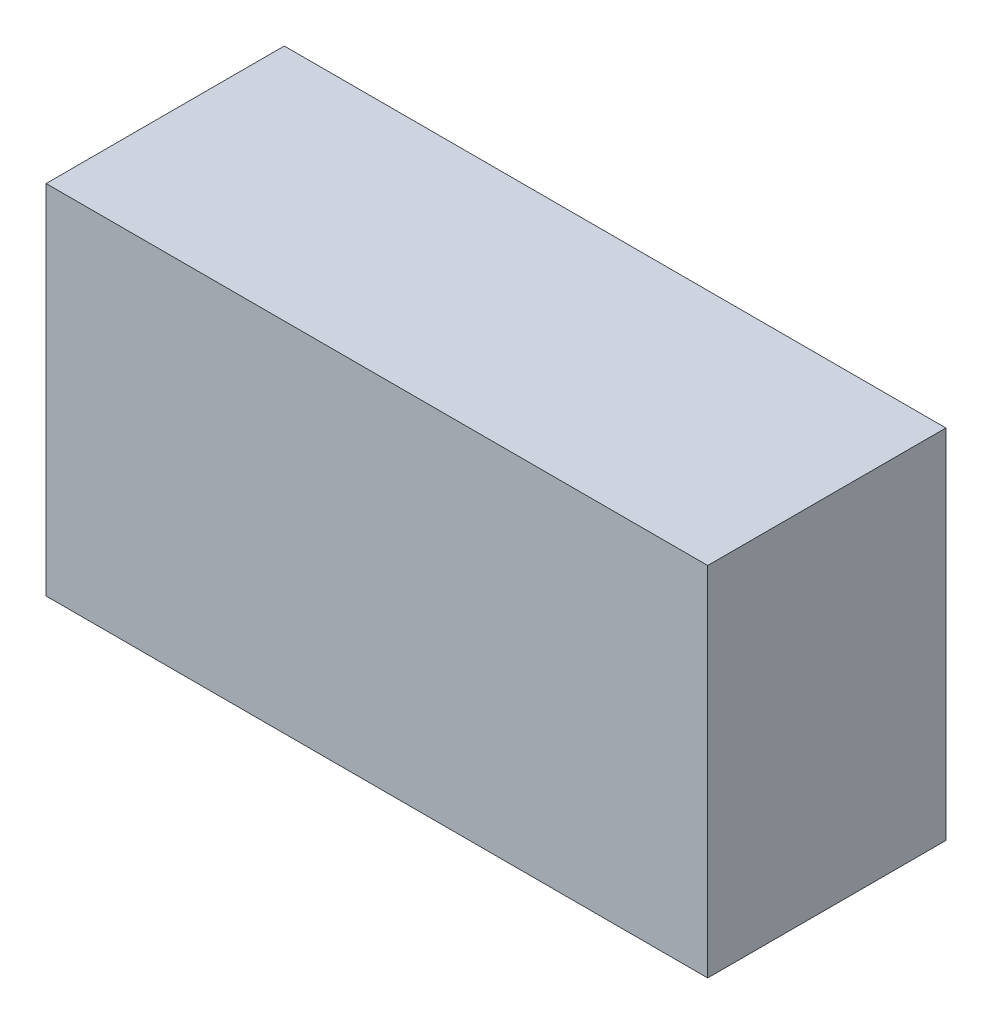
ISO-10303-21;
HEADER;
FILE_DESCRIPTION(('STEP AP214'),'2;1');
FILE_NAME('part.step','',(''),(''),'','','');
FILE_SCHEMA(('AUTOMOTIVE_DESIGN { 1 0 10303 214 1 1 1 1 }'));
ENDSEC;
DATA;
#1=APPLICATION_CONTEXT('core data for automotive mechanical design processes');
#2=APPLICATION_PROTOCOL_DEFINITION('international standard','automotive_design',2000,#1);
#3=PRODUCT_CONTEXT('',#1,'mechanical');
#4=PRODUCT('Part','Part','',(#3));
#5=PRODUCT_RELATED_PRODUCT_CATEGORY('part','',(#4));
#6=PRODUCT_DEFINITION_FORMATION('','',#4);
#7=PRODUCT_DEFINITION_CONTEXT('part definition',#1,'design');
#8=PRODUCT_DEFINITION('design','',#6,#7);
#9=PRODUCT_DEFINITION_SHAPE('','',#8);
#10=(LENGTH_UNIT() NAMED_UNIT(*) SI_UNIT(.MILLI.,.METRE.));
#11=(NAMED_UNIT(*) PLANE_ANGLE_UNIT() SI_UNIT($,.RADIAN.));
#12=(NAMED_UNIT(*) SI_UNIT($,.STERADIAN.) SOLID_ANGLE_UNIT());
#13=UNCERTAINTY_MEASURE_WITH_UNIT(LENGTH_MEASURE(1.E-05),#10,'distance_accuracy_value','');
#14=(GEOMETRIC_REPRESENTATION_CONTEXT(3) GLOBAL_UNCERTAINTY_ASSIGNED_CONTEXT((#13)) GLOBAL_UNIT_ASSIGNED_CONTEXT((#10,
#11,#12)) REPRESENTATION_CONTEXT('',''));
#15=CARTESIAN_POINT('',(0.,0.,0.));
#16=DIRECTION('',(0.,0.,1.));
#17=DIRECTION('',(1.,0.,0.));
#18=AXIS2_PLACEMENT_3D('',#15,#16,#17);
#19=CARTESIAN_POINT('',(-50.,27.,18.));
#20=DIRECTION('',(1.,0.,0.));
#21=DIRECTION('',(0.,1.,0.));
#22=AXIS2_PLACEMENT_3D('',#19,#20,#21);
#23=PLANE('',#22);
#24=CARTESIAN_POINT('',(-50.,20.25,9.));
#25=DIRECTION('',(1.,0.,0.));
#26=DIRECTION('',(0.,1.,0.));
#27=AXIS2_PLACEMENT_3D('',#24,#25,#26);
#28=CIRCLE('',#27,3.);
#29=CARTESIAN_POINT('',(-50.,23.25,9.));
#30=VERTEX_POINT('',#29);
#31=EDGE_CURVE('E111',#30,#30,#28,.F.);
#32=ORIENTED_EDGE('',*,*,#31,.F.);
#33=EDGE_LOOP('',(#32));
#34=FACE_BOUND('',#33,.T.);
#35=DIRECTION('',(0.,-1.,0.));
#36=VECTOR('',#35,1.);
#37=CARTESIAN_POINT('',(-50.,27.,0.));
#38=LINE('',#37,#36);
#39=CARTESIAN_POINT('',(-50.,27.,0.));
#40=VERTEX_POINT('',#39);
#41=CARTESIAN_POINT('',(-50.,0.,0.));
#42=VERTEX_POINT('',#41);
#43=EDGE_CURVE('E101',#40,#42,#38,.T.);
#44=ORIENTED_EDGE('',*,*,#43,.T.);
#45=DIRECTION('',(0.,0.,-1.));
#46=VECTOR('',#45,1.);
#47=CARTESIAN_POINT('',(-50.,0.,18.));
#48=LINE('',#47,#46);
#49=CARTESIAN_POINT('',(-50.,0.,18.));
#50=VERTEX_POINT('',#49);
#51=EDGE_CURVE('E92',#50,#42,#48,.T.);
#52=ORIENTED_EDGE('',*,*,#51,.F.);
#53=DIRECTION('',(0.,-1.,0.));
#54=VECTOR('',#53,1.);
#55=CARTESIAN_POINT('',(-50.,27.,18.));
#56=LINE('',#55,#54);
#57=CARTESIAN_POINT('',(-50.,27.,18.));
#58=VERTEX_POINT('',#57);
#59=EDGE_CURVE('E86',#58,#50,#56,.T.);
#60=ORIENTED_EDGE('',*,*,#59,.F.);
#61=DIRECTION('',(0.,0.,-1.));
#62=VECTOR('',#61,1.);
#63=CARTESIAN_POINT('',(-50.,27.,18.));
#64=LINE('',#63,#62);
#65=EDGE_CURVE('E97',#58,#40,#64,.T.);
#66=ORIENTED_EDGE('',*,*,#65,.T.);
#67=EDGE_LOOP('',(#44,#52,#60,#66));
#68=FACE_BOUND('',#67,.T.);
#69=CARTESIAN_POINT('',(-50.,6.74999999999997,9.));
#70=DIRECTION('',(1.,0.,0.));
#71=DIRECTION('',(0.,1.,0.));
#72=AXIS2_PLACEMENT_3D('',#69,#70,#71);
#73=CIRCLE('',#72,3.);
#74=CARTESIAN_POINT('',(-50.,9.74999999999997,9.));
#75=VERTEX_POINT('',#74);
#76=EDGE_CURVE('E114',#75,#75,#73,.F.);
#77=ORIENTED_EDGE('',*,*,#76,.F.);
#78=EDGE_LOOP('',(#77));
#79=FACE_BOUND('',#78,.T.);
#80=ADVANCED_FACE('F33',(#34,#68,#79),#23,.F.);
#81=CARTESIAN_POINT('',(-50.,0.,18.));
#82=DIRECTION('',(0.,1.,0.));
#83=DIRECTION('',(0.,0.,1.));
#84=AXIS2_PLACEMENT_3D('',#81,#82,#83);
#85=PLANE('',#84);
#86=DIRECTION('',(1.,0.,0.));
#87=VECTOR('',#86,1.);
#88=CARTESIAN_POINT('',(-50.,0.,0.));
#89=LINE('',#88,#87);
#90=CARTESIAN_POINT('',(0.,0.,0.));
#91=VERTEX_POINT('',#90);
#92=EDGE_CURVE('E91',#42,#91,#89,.T.);
#93=ORIENTED_EDGE('',*,*,#92,.T.);
#94=DIRECTION('',(0.,0.,-1.));
#95=VECTOR('',#94,1.);
#96=CARTESIAN_POINT('',(0.,0.,18.));
#97=LINE('',#96,#95);
#98=CARTESIAN_POINT('',(0.,0.,18.));
#99=VERTEX_POINT('',#98);
#100=EDGE_CURVE('E89',#99,#91,#97,.T.);
#101=ORIENTED_EDGE('',*,*,#100,.F.);
#102=DIRECTION('',(1.,0.,0.));
#103=VECTOR('',#102,1.);
#104=CARTESIAN_POINT('',(-50.,0.,18.));
#105=LINE('',#104,#103);
#106=EDGE_CURVE('E81',#50,#99,#105,.T.);
#107=ORIENTED_EDGE('',*,*,#106,.F.);
#108=ORIENTED_EDGE('',*,*,#51,.T.);
#109=EDGE_LOOP('',(#93,#101,#107,#108));
#110=FACE_BOUND('',#109,.T.);
#111=ADVANCED_FACE('F90',(#110),#85,.F.);
#112=CARTESIAN_POINT('',(0.,27.,18.));
#113=DIRECTION('',(-1.,0.,0.));
#114=DIRECTION('',(0.,-1.,0.));
#115=AXIS2_PLACEMENT_3D('',#112,#113,#114);
#116=PLANE('',#115);
#117=DIRECTION('',(0.,1.,0.));
#118=VECTOR('',#117,1.);
#119=CARTESIAN_POINT('',(0.,27.,0.));
#120=LINE('',#119,#118);
#121=CARTESIAN_POINT('',(0.,27.,0.));
#122=VERTEX_POINT('',#121);
#123=EDGE_CURVE('E67',#91,#122,#120,.T.);
#124=ORIENTED_EDGE('',*,*,#123,.T.);
#125=DIRECTION('',(0.,0.,-1.));
#126=VECTOR('',#125,1.);
#127=CARTESIAN_POINT('',(0.,27.,18.));
#128=LINE('',#127,#126);
#129=CARTESIAN_POINT('',(0.,27.,18.));
#130=VERTEX_POINT('',#129);
#131=EDGE_CURVE('E93',#130,#122,#128,.T.);
#132=ORIENTED_EDGE('',*,*,#131,.F.);
#133=DIRECTION('',(0.,1.,0.));
#134=VECTOR('',#133,1.);
#135=CARTESIAN_POINT('',(0.,27.,18.));
#136=LINE('',#135,#134);
#137=EDGE_CURVE('E84',#99,#130,#136,.T.);
#138=ORIENTED_EDGE('',*,*,#137,.F.);
#139=ORIENTED_EDGE('',*,*,#100,.T.);
#140=EDGE_LOOP('',(#124,#132,#138,#139));
#141=FACE_BOUND('',#140,.T.);
#142=ADVANCED_FACE('F95',(#141),#116,.F.);
#143=CARTESIAN_POINT('',(-50.,27.,18.));
#144=DIRECTION('',(0.,-1.,0.));
#145=DIRECTION('',(1.,0.,0.));
#146=AXIS2_PLACEMENT_3D('',#143,#144,#145);
#147=PLANE('',#146);
#148=DIRECTION('',(-1.,0.,0.));
#149=VECTOR('',#148,1.);
#150=CARTESIAN_POINT('',(-50.,27.,0.));
#151=LINE('',#150,#149);
#152=EDGE_CURVE('E73',#122,#40,#151,.T.);
#153=ORIENTED_EDGE('',*,*,#152,.T.);
#154=ORIENTED_EDGE('',*,*,#65,.F.);
#155=DIRECTION('',(-1.,0.,0.));
#156=VECTOR('',#155,1.);
#157=CARTESIAN_POINT('',(-50.,27.,18.));
#158=LINE('',#157,#156);
#159=EDGE_CURVE('E50',#130,#58,#158,.T.);
#160=ORIENTED_EDGE('',*,*,#159,.F.);
#161=ORIENTED_EDGE('',*,*,#131,.T.);
#162=EDGE_LOOP('',(#153,#154,#160,#161));
#163=FACE_BOUND('',#162,.T.);
#164=ADVANCED_FACE('F155',(#163),#147,.F.);
#165=CARTESIAN_POINT('',(0.,0.,18.));
#166=DIRECTION('',(0.,0.,1.));
#167=DIRECTION('',(1.,0.,0.));
#168=AXIS2_PLACEMENT_3D('',#165,#166,#167);
#169=PLANE('',#168);
#170=ORIENTED_EDGE('',*,*,#59,.T.);
#171=ORIENTED_EDGE('',*,*,#106,.T.);
#172=ORIENTED_EDGE('',*,*,#137,.T.);
#173=ORIENTED_EDGE('',*,*,#159,.T.);
#174=EDGE_LOOP('',(#170,#171,#172,#173));
#175=FACE_BOUND('',#174,.T.);
#176=ADVANCED_FACE('F82',(#175),#169,.T.);
#177=CARTESIAN_POINT('',(0.,0.,0.));
#178=DIRECTION('',(0.,0.,1.));
#179=DIRECTION('',(1.,0.,0.));
#180=AXIS2_PLACEMENT_3D('',#177,#178,#179);
#181=PLANE('',#180);
#182=ORIENTED_EDGE('',*,*,#43,.F.);
#183=ORIENTED_EDGE('',*,*,#152,.F.);
#184=ORIENTED_EDGE('',*,*,#123,.F.);
#185=ORIENTED_EDGE('',*,*,#92,.F.);
#186=EDGE_LOOP('',(#182,#183,#184,#185));
#187=FACE_BOUND('',#186,.T.);
#188=ADVANCED_FACE('F141',(#187),#181,.F.);
#189=CARTESIAN_POINT('',(-52.,20.25,9.));
#190=DIRECTION('',(1.,0.,0.));
#191=DIRECTION('',(0.,1.,0.));
#192=AXIS2_PLACEMENT_3D('',#189,#190,#191);
#193=CYLINDRICAL_SURFACE('',#192,3.);
#194=CARTESIAN_POINT('',(-51.,20.25,9.));
#195=DIRECTION('',(-1.,0.,0.));
#196=DIRECTION('',(0.,-1.,0.));
#197=AXIS2_PLACEMENT_3D('',#194,#195,#196);
#198=CIRCLE('',#197,3.);
#199=CARTESIAN_POINT('',(-51.,17.25,9.));
#200=VERTEX_POINT('',#199);
#201=EDGE_CURVE('E42',#200,#200,#198,.F.);
#202=ORIENTED_EDGE('',*,*,#201,.T.);
#203=EDGE_LOOP('',(#202));
#204=FACE_BOUND('',#203,.T.);
#205=ORIENTED_EDGE('',*,*,#31,.T.);
#206=EDGE_LOOP('',(#205));
#207=FACE_BOUND('',#206,.T.);
#208=ADVANCED_FACE('F122',(#204,#207),#193,.T.);
#209=CARTESIAN_POINT('',(-52.,20.25,9.));
#210=DIRECTION('',(-1.,0.,0.));
#211=DIRECTION('',(0.,-1.,0.));
#212=AXIS2_PLACEMENT_3D('',#209,#210,#211);
#213=PLANE('',#212);
#214=CARTESIAN_POINT('',(-52.,20.25,9.));
#215=DIRECTION('',(-1.,0.,0.));
#216=DIRECTION('',(0.,-1.,0.));
#217=AXIS2_PLACEMENT_3D('',#214,#215,#216);
#218=CIRCLE('',#217,2.);
#219=CARTESIAN_POINT('',(-52.,18.25,9.));
#220=VERTEX_POINT('',#219);
#221=EDGE_CURVE('E117',#220,#220,#218,.T.);
#222=ORIENTED_EDGE('',*,*,#221,.T.);
#223=EDGE_LOOP('',(#222));
#224=FACE_BOUND('',#223,.T.);
#225=ADVANCED_FACE('F132',(#224),#213,.T.);
#226=CARTESIAN_POINT('',(-52.,6.74999999999997,9.));
#227=DIRECTION('',(1.,0.,0.));
#228=DIRECTION('',(0.,1.,0.));
#229=AXIS2_PLACEMENT_3D('',#226,#227,#228);
#230=CYLINDRICAL_SURFACE('',#229,3.);
#231=CARTESIAN_POINT('',(-52.,6.74999999999997,9.));
#232=DIRECTION('',(-1.,0.,0.));
#233=DIRECTION('',(0.,-1.,0.));
#234=AXIS2_PLACEMENT_3D('',#231,#232,#233);
#235=CIRCLE('',#234,3.);
#236=CARTESIAN_POINT('',(-52.,3.74999999999997,9.));
#237=VERTEX_POINT('',#236);
#238=EDGE_CURVE('E104',#237,#237,#235,.T.);
#239=ORIENTED_EDGE('',*,*,#238,.F.);
#240=EDGE_LOOP('',(#239));
#241=FACE_BOUND('',#240,.T.);
#242=ORIENTED_EDGE('',*,*,#76,.T.);
#243=EDGE_LOOP('',(#242));
#244=FACE_BOUND('',#243,.T.);
#245=ADVANCED_FACE('F129',(#241,#244),#230,.T.);
#246=CARTESIAN_POINT('',(-51.,20.25,9.));
#247=DIRECTION('',(-1.,0.,0.));
#248=DIRECTION('',(0.,-1.,0.));
#249=AXIS2_PLACEMENT_3D('',#246,#247,#248);
#250=TOROIDAL_SURFACE('',#249,2.,1.);
#251=ORIENTED_EDGE('',*,*,#201,.F.);
#252=EDGE_LOOP('',(#251));
#253=FACE_BOUND('',#252,.T.);
#254=ORIENTED_EDGE('',*,*,#221,.F.);
#255=EDGE_LOOP('',(#254));
#256=FACE_BOUND('',#255,.T.);
#257=ADVANCED_FACE('F125',(#253,#256),#250,.T.);
#258=CARTESIAN_POINT('',(-50.,6.74999999999997,9.));
#259=DIRECTION('',(-1.,0.,0.));
#260=DIRECTION('',(0.,-1.,0.));
#261=AXIS2_PLACEMENT_3D('',#258,#259,#260);
#262=CYLINDRICAL_SURFACE('',#261,2.25);
#263=CARTESIAN_POINT('',(-51.0317541634481,6.74999999999997,9.));
#264=DIRECTION('',(-1.,0.,0.));
#265=DIRECTION('',(0.,-1.,0.));
#266=AXIS2_PLACEMENT_3D('',#263,#264,#265);
#267=CIRCLE('',#266,2.25);
#268=CARTESIAN_POINT('',(-51.0317541634481,4.49999999999997,9.));
#269=VERTEX_POINT('',#268);
#270=EDGE_CURVE('E11',#269,#269,#267,.T.);
#271=ORIENTED_EDGE('',*,*,#270,.T.);
#272=EDGE_LOOP('',(#271));
#273=FACE_BOUND('',#272,.T.);
#274=CARTESIAN_POINT('',(-50.,6.74999999999997,9.));
#275=DIRECTION('',(-1.,0.,0.));
#276=DIRECTION('',(0.,-1.,0.));
#277=AXIS2_PLACEMENT_3D('',#274,#275,#276);
#278=CIRCLE('',#277,2.25);
#279=CARTESIAN_POINT('',(-50.,4.49999999999997,9.));
#280=VERTEX_POINT('',#279);
#281=EDGE_CURVE('E226',#280,#280,#278,.T.);
#282=ORIENTED_EDGE('',*,*,#281,.F.);
#283=EDGE_LOOP('',(#282));
#284=FACE_BOUND('',#283,.T.);
#285=ADVANCED_FACE('F128',(#273,#284),#262,.F.);
#286=CARTESIAN_POINT('',(-50.,6.74999999999997,9.));
#287=DIRECTION('',(-1.,0.,0.));
#288=DIRECTION('',(0.,-1.,0.));
#289=AXIS2_PLACEMENT_3D('',#286,#287,#288);
#290=PLANE('',#289);
#291=ORIENTED_EDGE('',*,*,#281,.T.);
#292=EDGE_LOOP('',(#291));
#293=FACE_BOUND('',#292,.T.);
#294=ADVANCED_FACE('F195',(#293),#290,.T.);
#295=CARTESIAN_POINT('',(-51.0317541634481,6.74999999999997,9.));
#296=DIRECTION('',(-1.,0.,0.));
#297=DIRECTION('',(0.,-1.,0.));
#298=AXIS2_PLACEMENT_3D('',#295,#296,#297);
#299=TOROIDAL_SURFACE('',#298,3.25,1.);
#300=ORIENTED_EDGE('',*,*,#238,.T.);
#301=EDGE_LOOP('',(#300));
#302=FACE_BOUND('',#301,.T.);
#303=ORIENTED_EDGE('',*,*,#270,.F.);
#304=EDGE_LOOP('',(#303));
#305=FACE_BOUND('',#304,.T.);
#306=ADVANCED_FACE('F35',(#302,#305),#299,.T.);
#307=CLOSED_SHELL('',(#80,#111,#142,#164,#176,#188,#208,#225,#245,#257,#285,#294,#306));
#308=MANIFOLD_SOLID_BREP('B2',#307);
#309=ADVANCED_BREP_SHAPE_REPRESENTATION('',(#18,#308),#14);
#310=SHAPE_DEFINITION_REPRESENTATION(#9,#309);
ENDSEC;
END-ISO-10303-21;
